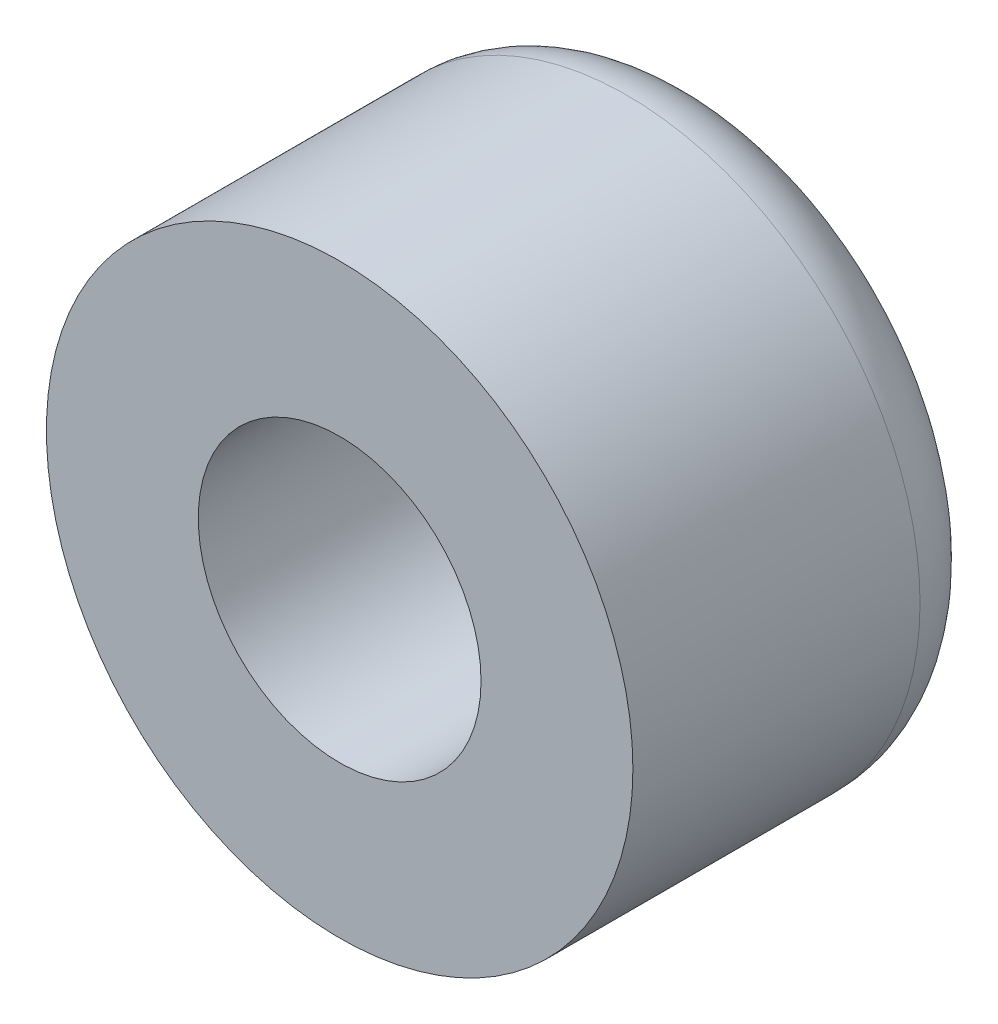
ISO-10303-21;
HEADER;
FILE_DESCRIPTION(('STEP AP214'),'2;1');
FILE_NAME('part.step','',(''),(''),'','','');
FILE_SCHEMA(('AUTOMOTIVE_DESIGN { 1 0 10303 214 1 1 1 1 }'));
ENDSEC;
DATA;
#1=APPLICATION_CONTEXT('core data for automotive mechanical design processes');
#2=APPLICATION_PROTOCOL_DEFINITION('international standard','automotive_design',2000,#1);
#3=PRODUCT_CONTEXT('',#1,'mechanical');
#4=PRODUCT('Part','Part','',(#3));
#5=PRODUCT_RELATED_PRODUCT_CATEGORY('part','',(#4));
#6=PRODUCT_DEFINITION_FORMATION('','',#4);
#7=PRODUCT_DEFINITION_CONTEXT('part definition',#1,'design');
#8=PRODUCT_DEFINITION('design','',#6,#7);
#9=PRODUCT_DEFINITION_SHAPE('','',#8);
#10=(LENGTH_UNIT() NAMED_UNIT(*) SI_UNIT(.MILLI.,.METRE.));
#11=(NAMED_UNIT(*) PLANE_ANGLE_UNIT() SI_UNIT($,.RADIAN.));
#12=(NAMED_UNIT(*) SI_UNIT($,.STERADIAN.) SOLID_ANGLE_UNIT());
#13=UNCERTAINTY_MEASURE_WITH_UNIT(LENGTH_MEASURE(1.E-05),#10,'distance_accuracy_value','');
#14=(GEOMETRIC_REPRESENTATION_CONTEXT(3) GLOBAL_UNCERTAINTY_ASSIGNED_CONTEXT((#13)) GLOBAL_UNIT_ASSIGNED_CONTEXT((#10,
#11,#12)) REPRESENTATION_CONTEXT('',''));
#15=CARTESIAN_POINT('',(0.,0.,0.));
#16=DIRECTION('',(0.,0.,1.));
#17=DIRECTION('',(1.,0.,0.));
#18=AXIS2_PLACEMENT_3D('',#15,#16,#17);
#19=CARTESIAN_POINT('',(0.,0.,-12.3375000000005));
#20=DIRECTION('',(0.,0.,1.));
#21=DIRECTION('',(1.,0.,0.));
#22=AXIS2_PLACEMENT_3D('',#19,#20,#21);
#23=TOROIDAL_SURFACE('',#22,9.33750000000046,3.26249999999955);
#24=CARTESIAN_POINT('',(0.,0.,-12.3375000000005));
#25=DIRECTION('',(0.,0.,1.));
#26=DIRECTION('',(1.,0.,0.));
#27=AXIS2_PLACEMENT_3D('',#24,#25,#26);
#28=CIRCLE('',#27,12.6);
#29=CARTESIAN_POINT('',(12.6,0.,-12.3375000000005));
#30=VERTEX_POINT('',#29);
#31=EDGE_CURVE('E42',#30,#30,#28,.T.);
#32=ORIENTED_EDGE('',*,*,#31,.F.);
#33=EDGE_LOOP('',(#32));
#34=FACE_BOUND('',#33,.T.);
#35=CARTESIAN_POINT('',(0.,0.,-12.3375000000005));
#36=DIRECTION('',(0.,0.,1.));
#37=DIRECTION('',(1.,0.,0.));
#38=AXIS2_PLACEMENT_3D('',#35,#36,#37);
#39=CIRCLE('',#38,6.0750000000009);
#40=CARTESIAN_POINT('',(6.0750000000009,0.,-12.3375000000005));
#41=VERTEX_POINT('',#40);
#42=EDGE_CURVE('E10',#41,#41,#39,.F.);
#43=ORIENTED_EDGE('',*,*,#42,.F.);
#44=EDGE_LOOP('',(#43));
#45=FACE_BOUND('',#44,.T.);
#46=ADVANCED_FACE('F35',(#34,#45),#23,.T.);
#47=CARTESIAN_POINT('',(0.,0.,-51.238181771802));
#48=DIRECTION('',(0.,0.,1.));
#49=DIRECTION('',(1.,0.,0.));
#50=AXIS2_PLACEMENT_3D('',#47,#48,#49);
#51=CYLINDRICAL_SURFACE('',#50,12.6);
#52=ORIENTED_EDGE('',*,*,#31,.T.);
#53=EDGE_LOOP('',(#52));
#54=FACE_BOUND('',#53,.T.);
#55=CARTESIAN_POINT('',(0.,0.,0.));
#56=DIRECTION('',(0.,0.,1.));
#57=DIRECTION('',(1.,0.,0.));
#58=AXIS2_PLACEMENT_3D('',#55,#56,#57);
#59=CIRCLE('',#58,12.6);
#60=CARTESIAN_POINT('',(12.6,0.,0.));
#61=VERTEX_POINT('',#60);
#62=EDGE_CURVE('E46',#61,#61,#59,.T.);
#63=ORIENTED_EDGE('',*,*,#62,.F.);
#64=EDGE_LOOP('',(#63));
#65=FACE_BOUND('',#64,.T.);
#66=ADVANCED_FACE('F64',(#54,#65),#51,.T.);
#67=CARTESIAN_POINT('',(0.,0.,-51.238181771802));
#68=DIRECTION('',(0.,0.,1.));
#69=DIRECTION('',(1.,0.,0.));
#70=AXIS2_PLACEMENT_3D('',#67,#68,#69);
#71=CYLINDRICAL_SURFACE('',#70,6.0750000000009);
#72=ORIENTED_EDGE('',*,*,#42,.T.);
#73=EDGE_LOOP('',(#72));
#74=FACE_BOUND('',#73,.T.);
#75=CARTESIAN_POINT('',(0.,0.,0.));
#76=DIRECTION('',(0.,0.,1.));
#77=DIRECTION('',(1.,0.,0.));
#78=AXIS2_PLACEMENT_3D('',#75,#76,#77);
#79=CIRCLE('',#78,6.0750000000009);
#80=CARTESIAN_POINT('',(6.0750000000009,0.,0.));
#81=VERTEX_POINT('',#80);
#82=EDGE_CURVE('E50',#81,#81,#79,.T.);
#83=ORIENTED_EDGE('',*,*,#82,.T.);
#84=EDGE_LOOP('',(#83));
#85=FACE_BOUND('',#84,.T.);
#86=ADVANCED_FACE('F56',(#74,#85),#71,.F.);
#87=CARTESIAN_POINT('',(0.,0.,0.));
#88=DIRECTION('',(0.,0.,1.));
#89=DIRECTION('',(1.,0.,0.));
#90=AXIS2_PLACEMENT_3D('',#87,#88,#89);
#91=PLANE('',#90);
#92=ORIENTED_EDGE('',*,*,#82,.F.);
#93=EDGE_LOOP('',(#92));
#94=FACE_BOUND('',#93,.T.);
#95=ORIENTED_EDGE('',*,*,#62,.T.);
#96=EDGE_LOOP('',(#95));
#97=FACE_BOUND('',#96,.T.);
#98=ADVANCED_FACE('F58',(#94,#97),#91,.T.);
#99=CLOSED_SHELL('',(#46,#66,#86,#98));
#100=MANIFOLD_SOLID_BREP('B2',#99);
#101=ADVANCED_BREP_SHAPE_REPRESENTATION('',(#18,#100),#14);
#102=SHAPE_DEFINITION_REPRESENTATION(#9,#101);
ENDSEC;
END-ISO-10303-21;
